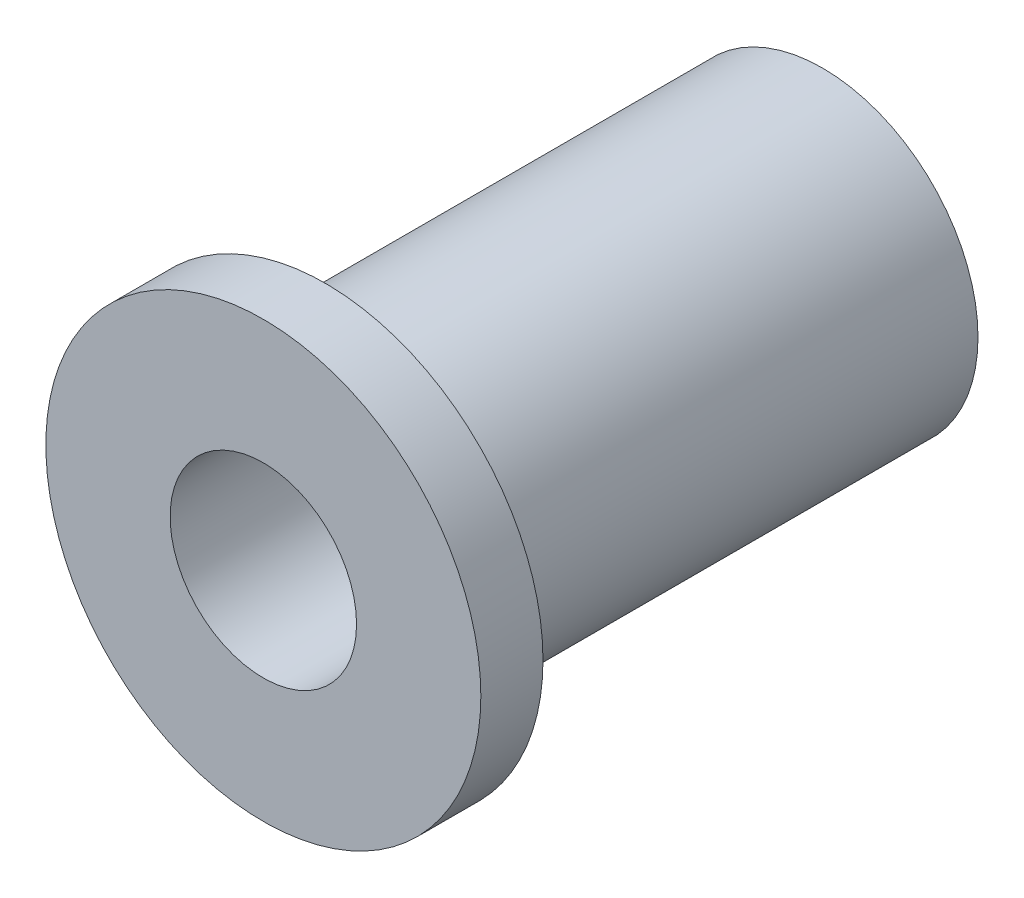
ISO-10303-21;
HEADER;
FILE_DESCRIPTION(('STEP AP214'),'2;1');
FILE_NAME('part.step','',(''),(''),'','','');
FILE_SCHEMA(('AUTOMOTIVE_DESIGN { 1 0 10303 214 1 1 1 1 }'));
ENDSEC;
DATA;
#1=APPLICATION_CONTEXT('core data for automotive mechanical design processes');
#2=APPLICATION_PROTOCOL_DEFINITION('international standard','automotive_design',2000,#1);
#3=PRODUCT_CONTEXT('',#1,'mechanical');
#4=PRODUCT('Part','Part','',(#3));
#5=PRODUCT_RELATED_PRODUCT_CATEGORY('part','',(#4));
#6=PRODUCT_DEFINITION_FORMATION('','',#4);
#7=PRODUCT_DEFINITION_CONTEXT('part definition',#1,'design');
#8=PRODUCT_DEFINITION('design','',#6,#7);
#9=PRODUCT_DEFINITION_SHAPE('','',#8);
#10=(LENGTH_UNIT() NAMED_UNIT(*) SI_UNIT(.MILLI.,.METRE.));
#11=(NAMED_UNIT(*) PLANE_ANGLE_UNIT() SI_UNIT($,.RADIAN.));
#12=(NAMED_UNIT(*) SI_UNIT($,.STERADIAN.) SOLID_ANGLE_UNIT());
#13=UNCERTAINTY_MEASURE_WITH_UNIT(LENGTH_MEASURE(1.E-05),#10,'distance_accuracy_value','');
#14=(GEOMETRIC_REPRESENTATION_CONTEXT(3) GLOBAL_UNCERTAINTY_ASSIGNED_CONTEXT((#13)) GLOBAL_UNIT_ASSIGNED_CONTEXT((#10,
#11,#12)) REPRESENTATION_CONTEXT('',''));
#15=CARTESIAN_POINT('',(0.,0.,0.));
#16=DIRECTION('',(0.,0.,1.));
#17=DIRECTION('',(1.,0.,0.));
#18=AXIS2_PLACEMENT_3D('',#15,#16,#17);
#19=CARTESIAN_POINT('',(0.,0.,0.));
#20=DIRECTION('',(0.,0.,1.));
#21=DIRECTION('',(1.,0.,0.));
#22=AXIS2_PLACEMENT_3D('',#19,#20,#21);
#23=PLANE('',#22);
#24=CARTESIAN_POINT('',(0.,0.,0.));
#25=DIRECTION('',(0.,0.,1.));
#26=DIRECTION('',(1.,0.,0.));
#27=AXIS2_PLACEMENT_3D('',#24,#25,#26);
#28=CIRCLE('',#27,5.55625);
#29=CARTESIAN_POINT('',(5.55625,0.,0.));
#30=VERTEX_POINT('',#29);
#31=EDGE_CURVE('E42',#30,#30,#28,.T.);
#32=ORIENTED_EDGE('',*,*,#31,.F.);
#33=EDGE_LOOP('',(#32));
#34=FACE_BOUND('',#33,.T.);
#35=CARTESIAN_POINT('',(0.,0.,0.));
#36=DIRECTION('',(0.,0.,1.));
#37=DIRECTION('',(1.,0.,0.));
#38=AXIS2_PLACEMENT_3D('',#35,#36,#37);
#39=CIRCLE('',#38,3.96875);
#40=CARTESIAN_POINT('',(3.96875,0.,0.));
#41=VERTEX_POINT('',#40);
#42=EDGE_CURVE('E10',#41,#41,#39,.F.);
#43=ORIENTED_EDGE('',*,*,#42,.F.);
#44=EDGE_LOOP('',(#43));
#45=FACE_BOUND('',#44,.T.);
#46=ADVANCED_FACE('F31',(#34,#45),#23,.F.);
#47=CARTESIAN_POINT('',(0.,0.,1.5875));
#48=DIRECTION('',(0.,0.,-1.));
#49=DIRECTION('',(-1.,0.,0.));
#50=AXIS2_PLACEMENT_3D('',#47,#48,#49);
#51=CYLINDRICAL_SURFACE('',#50,5.55625);
#52=CARTESIAN_POINT('',(0.,0.,1.5875));
#53=DIRECTION('',(0.,0.,1.));
#54=DIRECTION('',(1.,0.,0.));
#55=AXIS2_PLACEMENT_3D('',#52,#53,#54);
#56=CIRCLE('',#55,5.55625);
#57=CARTESIAN_POINT('',(5.55625,0.,1.5875));
#58=VERTEX_POINT('',#57);
#59=EDGE_CURVE('E38',#58,#58,#56,.T.);
#60=ORIENTED_EDGE('',*,*,#59,.F.);
#61=EDGE_LOOP('',(#60));
#62=FACE_BOUND('',#61,.T.);
#63=ORIENTED_EDGE('',*,*,#31,.T.);
#64=EDGE_LOOP('',(#63));
#65=FACE_BOUND('',#64,.T.);
#66=ADVANCED_FACE('F33',(#62,#65),#51,.T.);
#67=CARTESIAN_POINT('',(0.,0.,1.5875));
#68=DIRECTION('',(0.,0.,1.));
#69=DIRECTION('',(1.,0.,0.));
#70=AXIS2_PLACEMENT_3D('',#67,#68,#69);
#71=PLANE('',#70);
#72=CARTESIAN_POINT('',(0.,0.,1.5875));
#73=DIRECTION('',(0.,0.,1.));
#74=DIRECTION('',(1.,0.,0.));
#75=AXIS2_PLACEMENT_3D('',#72,#73,#74);
#76=CIRCLE('',#75,2.38125);
#77=CARTESIAN_POINT('',(2.38125,0.,1.5875));
#78=VERTEX_POINT('',#77);
#79=EDGE_CURVE('E52',#78,#78,#76,.T.);
#80=ORIENTED_EDGE('',*,*,#79,.F.);
#81=EDGE_LOOP('',(#80));
#82=FACE_BOUND('',#81,.T.);
#83=ORIENTED_EDGE('',*,*,#59,.T.);
#84=EDGE_LOOP('',(#83));
#85=FACE_BOUND('',#84,.T.);
#86=ADVANCED_FACE('F67',(#82,#85),#71,.T.);
#87=CARTESIAN_POINT('',(0.,0.,-12.7));
#88=DIRECTION('',(0.,0.,1.));
#89=DIRECTION('',(1.,0.,0.));
#90=AXIS2_PLACEMENT_3D('',#87,#88,#89);
#91=CYLINDRICAL_SURFACE('',#90,3.96875);
#92=CARTESIAN_POINT('',(0.,0.,-12.7));
#93=DIRECTION('',(0.,0.,-1.));
#94=DIRECTION('',(-1.,0.,0.));
#95=AXIS2_PLACEMENT_3D('',#92,#93,#94);
#96=CIRCLE('',#95,3.96875);
#97=CARTESIAN_POINT('',(-3.96875,0.,-12.7));
#98=VERTEX_POINT('',#97);
#99=EDGE_CURVE('E47',#98,#98,#96,.T.);
#100=ORIENTED_EDGE('',*,*,#99,.F.);
#101=EDGE_LOOP('',(#100));
#102=FACE_BOUND('',#101,.T.);
#103=ORIENTED_EDGE('',*,*,#42,.T.);
#104=EDGE_LOOP('',(#103));
#105=FACE_BOUND('',#104,.T.);
#106=ADVANCED_FACE('F69',(#102,#105),#91,.T.);
#107=CARTESIAN_POINT('',(0.,0.,-12.7));
#108=DIRECTION('',(0.,0.,-1.));
#109=DIRECTION('',(-1.,0.,0.));
#110=AXIS2_PLACEMENT_3D('',#107,#108,#109);
#111=PLANE('',#110);
#112=CARTESIAN_POINT('',(0.,0.,-12.7));
#113=DIRECTION('',(0.,0.,1.));
#114=DIRECTION('',(1.,0.,0.));
#115=AXIS2_PLACEMENT_3D('',#112,#113,#114);
#116=CIRCLE('',#115,2.38125);
#117=CARTESIAN_POINT('',(2.38125,0.,-12.7));
#118=VERTEX_POINT('',#117);
#119=EDGE_CURVE('E51',#118,#118,#116,.T.);
#120=ORIENTED_EDGE('',*,*,#119,.T.);
#121=EDGE_LOOP('',(#120));
#122=FACE_BOUND('',#121,.T.);
#123=ORIENTED_EDGE('',*,*,#99,.T.);
#124=EDGE_LOOP('',(#123));
#125=FACE_BOUND('',#124,.T.);
#126=ADVANCED_FACE('F58',(#122,#125),#111,.T.);
#127=CARTESIAN_POINT('',(0.,0.,-12.7));
#128=DIRECTION('',(0.,0.,1.));
#129=DIRECTION('',(1.,0.,0.));
#130=AXIS2_PLACEMENT_3D('',#127,#128,#129);
#131=CYLINDRICAL_SURFACE('',#130,2.38125);
#132=ORIENTED_EDGE('',*,*,#119,.F.);
#133=EDGE_LOOP('',(#132));
#134=FACE_BOUND('',#133,.T.);
#135=ORIENTED_EDGE('',*,*,#79,.T.);
#136=EDGE_LOOP('',(#135));
#137=FACE_BOUND('',#136,.T.);
#138=ADVANCED_FACE('F61',(#134,#137),#131,.F.);
#139=CLOSED_SHELL('',(#46,#66,#86,#106,#126,#138));
#140=MANIFOLD_SOLID_BREP('B2',#139);
#141=ADVANCED_BREP_SHAPE_REPRESENTATION('',(#18,#140),#14);
#142=SHAPE_DEFINITION_REPRESENTATION(#9,#141);
ENDSEC;
END-ISO-10303-21;
